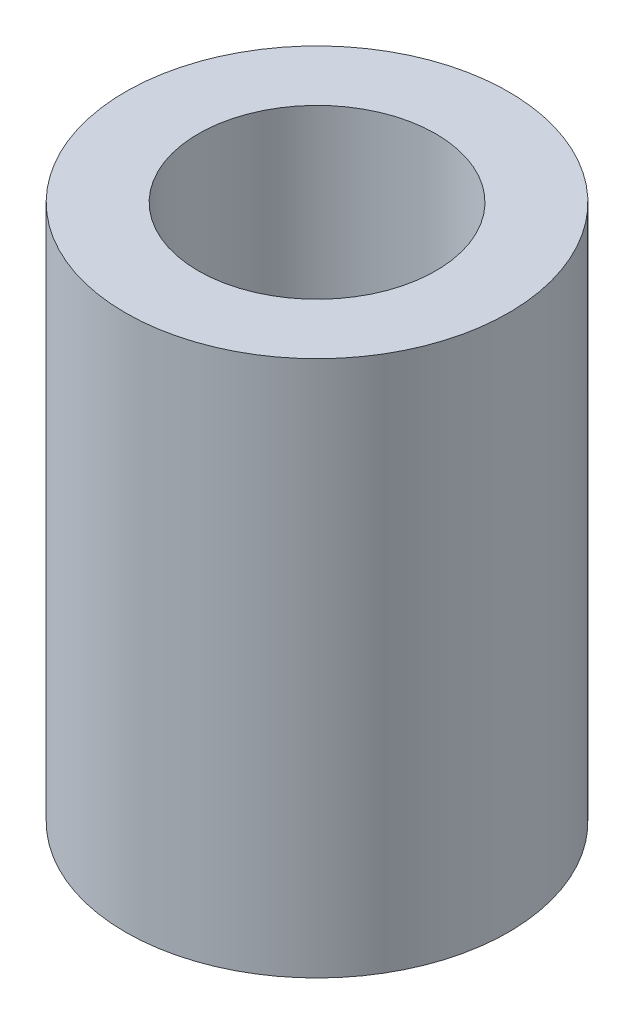
ISO-10303-21;
HEADER;
FILE_DESCRIPTION(('STEP AP214'),'2;1');
FILE_NAME('part.step','',(''),(''),'','','');
FILE_SCHEMA(('AUTOMOTIVE_DESIGN { 1 0 10303 214 1 1 1 1 }'));
ENDSEC;
DATA;
#1=APPLICATION_CONTEXT('core data for automotive mechanical design processes');
#2=APPLICATION_PROTOCOL_DEFINITION('international standard','automotive_design',2000,#1);
#3=PRODUCT_CONTEXT('',#1,'mechanical');
#4=PRODUCT('Part','Part','',(#3));
#5=PRODUCT_RELATED_PRODUCT_CATEGORY('part','',(#4));
#6=PRODUCT_DEFINITION_FORMATION('','',#4);
#7=PRODUCT_DEFINITION_CONTEXT('part definition',#1,'design');
#8=PRODUCT_DEFINITION('design','',#6,#7);
#9=PRODUCT_DEFINITION_SHAPE('','',#8);
#10=(LENGTH_UNIT() NAMED_UNIT(*) SI_UNIT(.MILLI.,.METRE.));
#11=(NAMED_UNIT(*) PLANE_ANGLE_UNIT() SI_UNIT($,.RADIAN.));
#12=(NAMED_UNIT(*) SI_UNIT($,.STERADIAN.) SOLID_ANGLE_UNIT());
#13=UNCERTAINTY_MEASURE_WITH_UNIT(LENGTH_MEASURE(1.E-05),#10,'distance_accuracy_value','');
#14=(GEOMETRIC_REPRESENTATION_CONTEXT(3) GLOBAL_UNCERTAINTY_ASSIGNED_CONTEXT((#13)) GLOBAL_UNIT_ASSIGNED_CONTEXT((#10,
#11,#12)) REPRESENTATION_CONTEXT('',''));
#15=CARTESIAN_POINT('',(0.,0.,0.));
#16=DIRECTION('',(0.,0.,1.));
#17=DIRECTION('',(1.,0.,0.));
#18=AXIS2_PLACEMENT_3D('',#15,#16,#17);
#19=CARTESIAN_POINT('',(-124.615384615385,-67.5,31.));
#20=DIRECTION('',(0.,1.,0.));
#21=DIRECTION('',(0.,0.,1.));
#22=AXIS2_PLACEMENT_3D('',#19,#20,#21);
#23=CYLINDRICAL_SURFACE('',#22,25.);
#24=CARTESIAN_POINT('',(-124.615384615385,-67.5,31.));
#25=DIRECTION('',(0.,1.,0.));
#26=DIRECTION('',(0.,0.,1.));
#27=AXIS2_PLACEMENT_3D('',#24,#25,#26);
#28=CIRCLE('',#27,25.);
#29=CARTESIAN_POINT('',(-124.615384615385,-67.5,56.));
#30=VERTEX_POINT('',#29);
#31=EDGE_CURVE('E10',#30,#30,#28,.T.);
#32=ORIENTED_EDGE('',*,*,#31,.T.);
#33=EDGE_LOOP('',(#32));
#34=FACE_BOUND('',#33,.T.);
#35=CARTESIAN_POINT('',(-124.615384615385,2.5,31.));
#36=DIRECTION('',(0.,1.,0.));
#37=DIRECTION('',(0.,0.,1.));
#38=AXIS2_PLACEMENT_3D('',#35,#36,#37);
#39=CIRCLE('',#38,25.);
#40=CARTESIAN_POINT('',(-124.615384615385,2.5,56.));
#41=VERTEX_POINT('',#40);
#42=EDGE_CURVE('E38',#41,#41,#39,.T.);
#43=ORIENTED_EDGE('',*,*,#42,.F.);
#44=EDGE_LOOP('',(#43));
#45=FACE_BOUND('',#44,.T.);
#46=ADVANCED_FACE('F35',(#34,#45),#23,.T.);
#47=CARTESIAN_POINT('',(-124.615384615385,-67.5,31.));
#48=DIRECTION('',(0.,1.,0.));
#49=DIRECTION('',(0.,0.,1.));
#50=AXIS2_PLACEMENT_3D('',#47,#48,#49);
#51=PLANE('',#50);
#52=CARTESIAN_POINT('',(-124.615384615385,-67.5,31.));
#53=DIRECTION('',(0.,1.,0.));
#54=DIRECTION('',(0.,0.,1.));
#55=AXIS2_PLACEMENT_3D('',#52,#53,#54);
#56=CIRCLE('',#55,15.5);
#57=CARTESIAN_POINT('',(-124.615384615385,-67.5,46.5));
#58=VERTEX_POINT('',#57);
#59=EDGE_CURVE('E45',#58,#58,#56,.T.);
#60=ORIENTED_EDGE('',*,*,#59,.T.);
#61=EDGE_LOOP('',(#60));
#62=FACE_BOUND('',#61,.T.);
#63=ORIENTED_EDGE('',*,*,#31,.F.);
#64=EDGE_LOOP('',(#63));
#65=FACE_BOUND('',#64,.T.);
#66=ADVANCED_FACE('F53',(#62,#65),#51,.F.);
#67=CARTESIAN_POINT('',(-124.615384615385,2.5,31.));
#68=DIRECTION('',(0.,1.,0.));
#69=DIRECTION('',(0.,0.,1.));
#70=AXIS2_PLACEMENT_3D('',#67,#68,#69);
#71=PLANE('',#70);
#72=CARTESIAN_POINT('',(-124.615384615385,2.5,31.));
#73=DIRECTION('',(0.,1.,0.));
#74=DIRECTION('',(0.,0.,1.));
#75=AXIS2_PLACEMENT_3D('',#72,#73,#74);
#76=CIRCLE('',#75,15.5);
#77=CARTESIAN_POINT('',(-124.615384615385,2.5,46.5));
#78=VERTEX_POINT('',#77);
#79=EDGE_CURVE('E47',#78,#78,#76,.T.);
#80=ORIENTED_EDGE('',*,*,#79,.F.);
#81=EDGE_LOOP('',(#80));
#82=FACE_BOUND('',#81,.T.);
#83=ORIENTED_EDGE('',*,*,#42,.T.);
#84=EDGE_LOOP('',(#83));
#85=FACE_BOUND('',#84,.T.);
#86=ADVANCED_FACE('F59',(#82,#85),#71,.T.);
#87=CARTESIAN_POINT('',(-124.615384615385,-67.5,31.));
#88=DIRECTION('',(0.,1.,0.));
#89=DIRECTION('',(0.,0.,1.));
#90=AXIS2_PLACEMENT_3D('',#87,#88,#89);
#91=CYLINDRICAL_SURFACE('',#90,15.5);
#92=ORIENTED_EDGE('',*,*,#59,.F.);
#93=EDGE_LOOP('',(#92));
#94=FACE_BOUND('',#93,.T.);
#95=ORIENTED_EDGE('',*,*,#79,.T.);
#96=EDGE_LOOP('',(#95));
#97=FACE_BOUND('',#96,.T.);
#98=ADVANCED_FACE('F56',(#94,#97),#91,.F.);
#99=CLOSED_SHELL('',(#46,#66,#86,#98));
#100=MANIFOLD_SOLID_BREP('B2',#99);
#101=ADVANCED_BREP_SHAPE_REPRESENTATION('',(#18,#100),#14);
#102=SHAPE_DEFINITION_REPRESENTATION(#9,#101);
ENDSEC;
END-ISO-10303-21;
